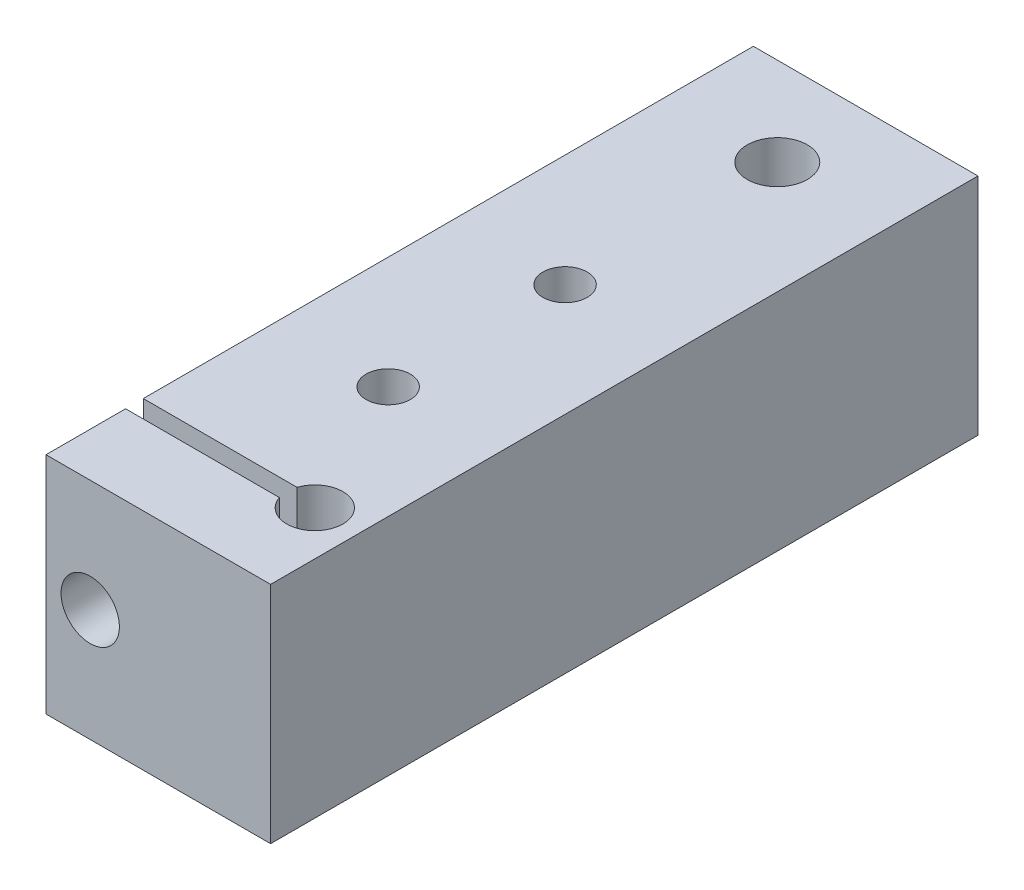
ISO-10303-21;
HEADER;
FILE_DESCRIPTION(('STEP AP214'),'2;1');
FILE_NAME('part.step','',(''),(''),'','','');
FILE_SCHEMA(('AUTOMOTIVE_DESIGN { 1 0 10303 214 1 1 1 1 }'));
ENDSEC;
DATA;
#1=APPLICATION_CONTEXT('core data for automotive mechanical design processes');
#2=APPLICATION_PROTOCOL_DEFINITION('international standard','automotive_design',2000,#1);
#3=PRODUCT_CONTEXT('',#1,'mechanical');
#4=PRODUCT('Part','Part','',(#3));
#5=PRODUCT_RELATED_PRODUCT_CATEGORY('part','',(#4));
#6=PRODUCT_DEFINITION_FORMATION('','',#4);
#7=PRODUCT_DEFINITION_CONTEXT('part definition',#1,'design');
#8=PRODUCT_DEFINITION('design','',#6,#7);
#9=PRODUCT_DEFINITION_SHAPE('','',#8);
#10=(LENGTH_UNIT() NAMED_UNIT(*) SI_UNIT(.MILLI.,.METRE.));
#11=(NAMED_UNIT(*) PLANE_ANGLE_UNIT() SI_UNIT($,.RADIAN.));
#12=(NAMED_UNIT(*) SI_UNIT($,.STERADIAN.) SOLID_ANGLE_UNIT());
#13=UNCERTAINTY_MEASURE_WITH_UNIT(LENGTH_MEASURE(1.E-05),#10,'distance_accuracy_value','');
#14=(GEOMETRIC_REPRESENTATION_CONTEXT(3) GLOBAL_UNCERTAINTY_ASSIGNED_CONTEXT((#13)) GLOBAL_UNIT_ASSIGNED_CONTEXT((#10,
#11,#12)) REPRESENTATION_CONTEXT('',''));
#15=CARTESIAN_POINT('',(0.,0.,0.));
#16=DIRECTION('',(0.,0.,1.));
#17=DIRECTION('',(1.,0.,0.));
#18=AXIS2_PLACEMENT_3D('',#15,#16,#17);
#19=CARTESIAN_POINT('',(0.,25.4,0.));
#20=DIRECTION('',(1.,0.,0.));
#21=DIRECTION('',(0.,0.,-1.));
#22=AXIS2_PLACEMENT_3D('',#19,#20,#21);
#23=PLANE('',#22);
#24=DIRECTION('',(0.,0.,1.));
#25=VECTOR('',#24,1.);
#26=CARTESIAN_POINT('',(0.,25.4,0.));
#27=LINE('',#26,#25);
#28=CARTESIAN_POINT('',(0.,25.4,-9.));
#29=VERTEX_POINT('',#28);
#30=CARTESIAN_POINT('',(0.,25.4,0.));
#31=VERTEX_POINT('',#30);
#32=EDGE_CURVE('E150',#29,#31,#27,.T.);
#33=ORIENTED_EDGE('',*,*,#32,.F.);
#34=DIRECTION('',(0.,1.,0.));
#35=VECTOR('',#34,1.);
#36=CARTESIAN_POINT('',(0.,0.,-9.));
#37=LINE('',#36,#35);
#38=CARTESIAN_POINT('',(0.,0.,-9.));
#39=VERTEX_POINT('',#38);
#40=EDGE_CURVE('E135',#39,#29,#37,.T.);
#41=ORIENTED_EDGE('',*,*,#40,.F.);
#42=DIRECTION('',(0.,0.,1.));
#43=VECTOR('',#42,1.);
#44=CARTESIAN_POINT('',(0.,0.,0.));
#45=LINE('',#44,#43);
#46=CARTESIAN_POINT('',(0.,0.,0.));
#47=VERTEX_POINT('',#46);
#48=EDGE_CURVE('E145',#39,#47,#45,.T.);
#49=ORIENTED_EDGE('',*,*,#48,.T.);
#50=DIRECTION('',(0.,-1.,0.));
#51=VECTOR('',#50,1.);
#52=CARTESIAN_POINT('',(0.,25.4,0.));
#53=LINE('',#52,#51);
#54=EDGE_CURVE('E174',#31,#47,#53,.T.);
#55=ORIENTED_EDGE('',*,*,#54,.F.);
#56=EDGE_LOOP('',(#33,#41,#49,#55));
#57=FACE_BOUND('',#56,.T.);
#58=ADVANCED_FACE('F39',(#57),#23,.F.);
#59=CARTESIAN_POINT('',(0.,0.,-80.));
#60=VERTEX_POINT('',#59);
#61=CARTESIAN_POINT('',(0.,0.,-11.));
#62=VERTEX_POINT('',#61);
#63=EDGE_CURVE('E157',#60,#62,#45,.T.);
#64=ORIENTED_EDGE('',*,*,#63,.T.);
#65=DIRECTION('',(0.,1.,0.));
#66=VECTOR('',#65,1.);
#67=CARTESIAN_POINT('',(0.,0.,-11.));
#68=LINE('',#67,#66);
#69=CARTESIAN_POINT('',(0.,25.4,-11.));
#70=VERTEX_POINT('',#69);
#71=EDGE_CURVE('E132',#62,#70,#68,.T.);
#72=ORIENTED_EDGE('',*,*,#71,.T.);
#73=CARTESIAN_POINT('',(0.,25.4,-80.));
#74=VERTEX_POINT('',#73);
#75=EDGE_CURVE('E146',#74,#70,#27,.T.);
#76=ORIENTED_EDGE('',*,*,#75,.F.);
#77=DIRECTION('',(0.,-1.,0.));
#78=VECTOR('',#77,1.);
#79=CARTESIAN_POINT('',(0.,25.4,-80.));
#80=LINE('',#79,#78);
#81=EDGE_CURVE('E156',#74,#60,#80,.T.);
#82=ORIENTED_EDGE('',*,*,#81,.T.);
#83=EDGE_LOOP('',(#64,#72,#76,#82));
#84=FACE_BOUND('',#83,.T.);
#85=ADVANCED_FACE('F41',(#84),#23,.F.);
#86=CARTESIAN_POINT('',(0.,25.4,0.));
#87=DIRECTION('',(0.,0.,-1.));
#88=DIRECTION('',(-1.,0.,0.));
#89=AXIS2_PLACEMENT_3D('',#86,#87,#88);
#90=PLANE('',#89);
#91=CARTESIAN_POINT('',(5.,12.7,0.));
#92=DIRECTION('',(0.,0.,1.));
#93=DIRECTION('',(1.,0.,0.));
#94=AXIS2_PLACEMENT_3D('',#91,#92,#93);
#95=CIRCLE('',#94,3.3);
#96=CARTESIAN_POINT('',(8.3,12.7,0.));
#97=VERTEX_POINT('',#96);
#98=EDGE_CURVE('E114',#97,#97,#95,.T.);
#99=ORIENTED_EDGE('',*,*,#98,.F.);
#100=EDGE_LOOP('',(#99));
#101=FACE_BOUND('',#100,.T.);
#102=DIRECTION('',(1.,0.,0.));
#103=VECTOR('',#102,1.);
#104=CARTESIAN_POINT('',(0.,0.,0.));
#105=LINE('',#104,#103);
#106=CARTESIAN_POINT('',(25.4,0.,0.));
#107=VERTEX_POINT('',#106);
#108=EDGE_CURVE('E160',#47,#107,#105,.T.);
#109=ORIENTED_EDGE('',*,*,#108,.T.);
#110=DIRECTION('',(0.,-1.,0.));
#111=VECTOR('',#110,1.);
#112=CARTESIAN_POINT('',(25.4,25.4,0.));
#113=LINE('',#112,#111);
#114=CARTESIAN_POINT('',(25.4,25.4,0.));
#115=VERTEX_POINT('',#114);
#116=EDGE_CURVE('E171',#115,#107,#113,.T.);
#117=ORIENTED_EDGE('',*,*,#116,.F.);
#118=DIRECTION('',(1.,0.,0.));
#119=VECTOR('',#118,1.);
#120=CARTESIAN_POINT('',(0.,25.4,0.));
#121=LINE('',#120,#119);
#122=EDGE_CURVE('E149',#31,#115,#121,.T.);
#123=ORIENTED_EDGE('',*,*,#122,.F.);
#124=ORIENTED_EDGE('',*,*,#54,.T.);
#125=EDGE_LOOP('',(#109,#117,#123,#124));
#126=FACE_BOUND('',#125,.T.);
#127=ADVANCED_FACE('F196',(#101,#126),#90,.F.);
#128=CARTESIAN_POINT('',(25.4,25.4,0.));
#129=DIRECTION('',(-1.,0.,0.));
#130=DIRECTION('',(0.,0.,1.));
#131=AXIS2_PLACEMENT_3D('',#128,#129,#130);
#132=PLANE('',#131);
#133=DIRECTION('',(0.,0.,-1.));
#134=VECTOR('',#133,1.);
#135=CARTESIAN_POINT('',(25.4,0.,0.));
#136=LINE('',#135,#134);
#137=CARTESIAN_POINT('',(25.4,0.,-80.));
#138=VERTEX_POINT('',#137);
#139=EDGE_CURVE('E162',#107,#138,#136,.T.);
#140=ORIENTED_EDGE('',*,*,#139,.T.);
#141=DIRECTION('',(0.,-1.,0.));
#142=VECTOR('',#141,1.);
#143=CARTESIAN_POINT('',(25.4,25.4,-80.));
#144=LINE('',#143,#142);
#145=CARTESIAN_POINT('',(25.4,25.4,-80.));
#146=VERTEX_POINT('',#145);
#147=EDGE_CURVE('E168',#146,#138,#144,.T.);
#148=ORIENTED_EDGE('',*,*,#147,.F.);
#149=DIRECTION('',(0.,0.,-1.));
#150=VECTOR('',#149,1.);
#151=CARTESIAN_POINT('',(25.4,25.4,0.));
#152=LINE('',#151,#150);
#153=EDGE_CURVE('E152',#115,#146,#152,.T.);
#154=ORIENTED_EDGE('',*,*,#153,.F.);
#155=ORIENTED_EDGE('',*,*,#116,.T.);
#156=EDGE_LOOP('',(#140,#148,#154,#155));
#157=FACE_BOUND('',#156,.T.);
#158=ADVANCED_FACE('F201',(#157),#132,.F.);
#159=CARTESIAN_POINT('',(0.,25.4,-80.));
#160=DIRECTION('',(0.,0.,1.));
#161=DIRECTION('',(1.,0.,0.));
#162=AXIS2_PLACEMENT_3D('',#159,#160,#161);
#163=PLANE('',#162);
#164=DIRECTION('',(-1.,0.,0.));
#165=VECTOR('',#164,1.);
#166=CARTESIAN_POINT('',(0.,0.,-80.));
#167=LINE('',#166,#165);
#168=EDGE_CURVE('E164',#138,#60,#167,.T.);
#169=ORIENTED_EDGE('',*,*,#168,.T.);
#170=ORIENTED_EDGE('',*,*,#81,.F.);
#171=DIRECTION('',(-1.,0.,0.));
#172=VECTOR('',#171,1.);
#173=CARTESIAN_POINT('',(0.,25.4,-80.));
#174=LINE('',#173,#172);
#175=EDGE_CURVE('E154',#146,#74,#174,.T.);
#176=ORIENTED_EDGE('',*,*,#175,.F.);
#177=ORIENTED_EDGE('',*,*,#147,.T.);
#178=EDGE_LOOP('',(#169,#170,#176,#177));
#179=FACE_BOUND('',#178,.T.);
#180=ADVANCED_FACE('F206',(#179),#163,.F.);
#181=CARTESIAN_POINT('',(0.,25.4,0.));
#182=DIRECTION('',(0.,-1.,0.));
#183=DIRECTION('',(0.,0.,-1.));
#184=AXIS2_PLACEMENT_3D('',#181,#182,#183);
#185=PLANE('',#184);
#186=CARTESIAN_POINT('',(12.7,25.4,-26.));
#187=DIRECTION('',(0.,-1.,0.));
#188=DIRECTION('',(0.,0.,-1.));
#189=AXIS2_PLACEMENT_3D('',#186,#187,#188);
#190=CIRCLE('',#189,2.49999999999999);
#191=CARTESIAN_POINT('',(12.7,25.4,-28.5));
#192=VERTEX_POINT('',#191);
#193=EDGE_CURVE('E247',#192,#192,#190,.F.);
#194=ORIENTED_EDGE('',*,*,#193,.F.);
#195=EDGE_LOOP('',(#194));
#196=FACE_BOUND('',#195,.T.);
#197=CARTESIAN_POINT('',(12.7,25.4,-46.));
#198=DIRECTION('',(0.,-1.,0.));
#199=DIRECTION('',(0.,0.,-1.));
#200=AXIS2_PLACEMENT_3D('',#197,#198,#199);
#201=CIRCLE('',#200,2.49999999999999);
#202=CARTESIAN_POINT('',(12.7,25.4,-48.5));
#203=VERTEX_POINT('',#202);
#204=EDGE_CURVE('E251',#203,#203,#201,.F.);
#205=ORIENTED_EDGE('',*,*,#204,.F.);
#206=EDGE_LOOP('',(#205));
#207=FACE_BOUND('',#206,.T.);
#208=CARTESIAN_POINT('',(12.7,25.4,-70.));
#209=DIRECTION('',(0.,1.,0.));
#210=DIRECTION('',(0.,0.,1.));
#211=AXIS2_PLACEMENT_3D('',#208,#209,#210);
#212=CIRCLE('',#211,3.39999999999999);
#213=CARTESIAN_POINT('',(12.7,25.4,-66.6));
#214=VERTEX_POINT('',#213);
#215=EDGE_CURVE('E254',#214,#214,#212,.T.);
#216=ORIENTED_EDGE('',*,*,#215,.F.);
#217=EDGE_LOOP('',(#216));
#218=FACE_BOUND('',#217,.T.);
#219=CARTESIAN_POINT('',(20.4,25.4,-10.));
#220=DIRECTION('',(0.,1.,0.));
#221=DIRECTION('',(0.,0.,1.));
#222=AXIS2_PLACEMENT_3D('',#219,#220,#221);
#223=CIRCLE('',#222,3.17499999999999);
#224=CARTESIAN_POINT('',(17.3865924603532,25.4,-9.));
#225=VERTEX_POINT('',#224);
#226=CARTESIAN_POINT('',(17.3865924603532,25.4,-11.));
#227=VERTEX_POINT('',#226);
#228=EDGE_CURVE('E137',#225,#227,#223,.T.);
#229=ORIENTED_EDGE('',*,*,#228,.F.);
#230=DIRECTION('',(1.,0.,0.));
#231=VECTOR('',#230,1.);
#232=CARTESIAN_POINT('',(0.,25.4,-9.));
#233=LINE('',#232,#231);
#234=EDGE_CURVE('E54',#29,#225,#233,.T.);
#235=ORIENTED_EDGE('',*,*,#234,.F.);
#236=ORIENTED_EDGE('',*,*,#32,.T.);
#237=ORIENTED_EDGE('',*,*,#122,.T.);
#238=ORIENTED_EDGE('',*,*,#153,.T.);
#239=ORIENTED_EDGE('',*,*,#175,.T.);
#240=ORIENTED_EDGE('',*,*,#75,.T.);
#241=DIRECTION('',(-1.,0.,0.));
#242=VECTOR('',#241,1.);
#243=CARTESIAN_POINT('',(0.,25.4,-11.));
#244=LINE('',#243,#242);
#245=EDGE_CURVE('E126',#227,#70,#244,.T.);
#246=ORIENTED_EDGE('',*,*,#245,.F.);
#247=EDGE_LOOP('',(#229,#235,#236,#237,#238,#239,#240,#246));
#248=FACE_BOUND('',#247,.T.);
#249=ADVANCED_FACE('F193',(#196,#207,#218,#248),#185,.F.);
#250=CARTESIAN_POINT('',(0.,0.,0.));
#251=DIRECTION('',(0.,-1.,0.));
#252=DIRECTION('',(0.,0.,-1.));
#253=AXIS2_PLACEMENT_3D('',#250,#251,#252);
#254=PLANE('',#253);
#255=CARTESIAN_POINT('',(12.7,0.,-26.));
#256=DIRECTION('',(0.,-1.,0.));
#257=DIRECTION('',(0.,0.,-1.));
#258=AXIS2_PLACEMENT_3D('',#255,#256,#257);
#259=CIRCLE('',#258,2.49999999999999);
#260=CARTESIAN_POINT('',(12.7,0.,-28.5));
#261=VERTEX_POINT('',#260);
#262=EDGE_CURVE('E263',#261,#261,#259,.T.);
#263=ORIENTED_EDGE('',*,*,#262,.F.);
#264=EDGE_LOOP('',(#263));
#265=FACE_BOUND('',#264,.T.);
#266=CARTESIAN_POINT('',(12.7,0.,-46.));
#267=DIRECTION('',(0.,-1.,0.));
#268=DIRECTION('',(0.,0.,-1.));
#269=AXIS2_PLACEMENT_3D('',#266,#267,#268);
#270=CIRCLE('',#269,2.49999999999999);
#271=CARTESIAN_POINT('',(12.7,0.,-48.5));
#272=VERTEX_POINT('',#271);
#273=EDGE_CURVE('E258',#272,#272,#270,.T.);
#274=ORIENTED_EDGE('',*,*,#273,.F.);
#275=EDGE_LOOP('',(#274));
#276=FACE_BOUND('',#275,.T.);
#277=CARTESIAN_POINT('',(12.7,0.,-70.));
#278=DIRECTION('',(0.,1.,0.));
#279=DIRECTION('',(0.,0.,1.));
#280=AXIS2_PLACEMENT_3D('',#277,#278,#279);
#281=CIRCLE('',#280,3.39999999999999);
#282=CARTESIAN_POINT('',(12.7,0.,-66.6));
#283=VERTEX_POINT('',#282);
#284=EDGE_CURVE('E121',#283,#283,#281,.T.);
#285=ORIENTED_EDGE('',*,*,#284,.T.);
#286=EDGE_LOOP('',(#285));
#287=FACE_BOUND('',#286,.T.);
#288=DIRECTION('',(1.,0.,0.));
#289=VECTOR('',#288,1.);
#290=CARTESIAN_POINT('',(0.,0.,-9.));
#291=LINE('',#290,#289);
#292=CARTESIAN_POINT('',(17.3865924603532,0.,-9.));
#293=VERTEX_POINT('',#292);
#294=EDGE_CURVE('E129',#39,#293,#291,.T.);
#295=ORIENTED_EDGE('',*,*,#294,.T.);
#296=CARTESIAN_POINT('',(20.4,0.,-10.));
#297=DIRECTION('',(0.,1.,0.));
#298=DIRECTION('',(0.,0.,1.));
#299=AXIS2_PLACEMENT_3D('',#296,#297,#298);
#300=CIRCLE('',#299,3.17499999999999);
#301=CARTESIAN_POINT('',(17.3865924603532,0.,-11.));
#302=VERTEX_POINT('',#301);
#303=EDGE_CURVE('E142',#293,#302,#300,.T.);
#304=ORIENTED_EDGE('',*,*,#303,.T.);
#305=DIRECTION('',(-1.,0.,0.));
#306=VECTOR('',#305,1.);
#307=CARTESIAN_POINT('',(0.,0.,-11.));
#308=LINE('',#307,#306);
#309=EDGE_CURVE('E61',#302,#62,#308,.T.);
#310=ORIENTED_EDGE('',*,*,#309,.T.);
#311=ORIENTED_EDGE('',*,*,#63,.F.);
#312=ORIENTED_EDGE('',*,*,#168,.F.);
#313=ORIENTED_EDGE('',*,*,#139,.F.);
#314=ORIENTED_EDGE('',*,*,#108,.F.);
#315=ORIENTED_EDGE('',*,*,#48,.F.);
#316=EDGE_LOOP('',(#295,#304,#310,#311,#312,#313,#314,#315));
#317=FACE_BOUND('',#316,.T.);
#318=ADVANCED_FACE('F182',(#265,#276,#287,#317),#254,.T.);
#319=CARTESIAN_POINT('',(20.4,25.4,-10.));
#320=DIRECTION('',(0.,1.,0.));
#321=DIRECTION('',(0.,0.,1.));
#322=AXIS2_PLACEMENT_3D('',#319,#320,#321);
#323=CYLINDRICAL_SURFACE('',#322,3.17499999999999);
#324=ORIENTED_EDGE('',*,*,#303,.F.);
#325=DIRECTION('',(0.,1.,0.));
#326=VECTOR('',#325,1.);
#327=CARTESIAN_POINT('',(17.3865924603532,25.4,-9.));
#328=LINE('',#327,#326);
#329=EDGE_CURVE('E11',#293,#225,#328,.T.);
#330=ORIENTED_EDGE('',*,*,#329,.T.);
#331=ORIENTED_EDGE('',*,*,#228,.T.);
#332=DIRECTION('',(0.,1.,0.));
#333=VECTOR('',#332,1.);
#334=CARTESIAN_POINT('',(17.3865924603532,25.4,-11.));
#335=LINE('',#334,#333);
#336=EDGE_CURVE('E47',#227,#302,#335,.F.);
#337=ORIENTED_EDGE('',*,*,#336,.T.);
#338=EDGE_LOOP('',(#324,#330,#331,#337));
#339=FACE_BOUND('',#338,.T.);
#340=ADVANCED_FACE('F178',(#339),#323,.F.);
#341=CARTESIAN_POINT('',(0.,0.,-11.));
#342=DIRECTION('',(0.,0.,-1.));
#343=DIRECTION('',(-1.,0.,0.));
#344=AXIS2_PLACEMENT_3D('',#341,#342,#343);
#345=PLANE('',#344);
#346=CARTESIAN_POINT('',(5.,12.7,-11.));
#347=DIRECTION('',(0.,0.,1.));
#348=DIRECTION('',(1.,0.,0.));
#349=AXIS2_PLACEMENT_3D('',#346,#347,#348);
#350=CIRCLE('',#349,2.5);
#351=CARTESIAN_POINT('',(7.5,12.7,-11.));
#352=VERTEX_POINT('',#351);
#353=EDGE_CURVE('E115',#352,#352,#350,.T.);
#354=ORIENTED_EDGE('',*,*,#353,.F.);
#355=EDGE_LOOP('',(#354));
#356=FACE_BOUND('',#355,.T.);
#357=ORIENTED_EDGE('',*,*,#245,.T.);
#358=ORIENTED_EDGE('',*,*,#71,.F.);
#359=ORIENTED_EDGE('',*,*,#309,.F.);
#360=ORIENTED_EDGE('',*,*,#336,.F.);
#361=EDGE_LOOP('',(#357,#358,#359,#360));
#362=FACE_BOUND('',#361,.T.);
#363=ADVANCED_FACE('F209',(#356,#362),#345,.F.);
#364=CARTESIAN_POINT('',(0.,0.,-9.));
#365=DIRECTION('',(0.,0.,1.));
#366=DIRECTION('',(1.,0.,0.));
#367=AXIS2_PLACEMENT_3D('',#364,#365,#366);
#368=PLANE('',#367);
#369=CARTESIAN_POINT('',(5.,12.7,-9.));
#370=DIRECTION('',(0.,0.,1.));
#371=DIRECTION('',(1.,0.,0.));
#372=AXIS2_PLACEMENT_3D('',#369,#370,#371);
#373=CIRCLE('',#372,3.3);
#374=CARTESIAN_POINT('',(8.3,12.7,-9.));
#375=VERTEX_POINT('',#374);
#376=EDGE_CURVE('E118',#375,#375,#373,.F.);
#377=ORIENTED_EDGE('',*,*,#376,.F.);
#378=EDGE_LOOP('',(#377));
#379=FACE_BOUND('',#378,.T.);
#380=ORIENTED_EDGE('',*,*,#294,.F.);
#381=ORIENTED_EDGE('',*,*,#40,.T.);
#382=ORIENTED_EDGE('',*,*,#234,.T.);
#383=ORIENTED_EDGE('',*,*,#329,.F.);
#384=EDGE_LOOP('',(#380,#381,#382,#383));
#385=FACE_BOUND('',#384,.T.);
#386=ADVANCED_FACE('F187',(#379,#385),#368,.F.);
#387=CARTESIAN_POINT('',(5.,12.7,0.));
#388=DIRECTION('',(0.,0.,1.));
#389=DIRECTION('',(1.,0.,0.));
#390=AXIS2_PLACEMENT_3D('',#387,#388,#389);
#391=CYLINDRICAL_SURFACE('',#390,3.3);
#392=ORIENTED_EDGE('',*,*,#376,.T.);
#393=EDGE_LOOP('',(#392));
#394=FACE_BOUND('',#393,.T.);
#395=ORIENTED_EDGE('',*,*,#98,.T.);
#396=EDGE_LOOP('',(#395));
#397=FACE_BOUND('',#396,.T.);
#398=ADVANCED_FACE('F108',(#394,#397),#391,.F.);
#399=CARTESIAN_POINT('',(5.,12.7,-28.));
#400=DIRECTION('',(0.,0.,1.));
#401=DIRECTION('',(1.,0.,0.));
#402=AXIS2_PLACEMENT_3D('',#399,#400,#401);
#403=CONICAL_SURFACE('',#402,2.5,1.02974425867665);
#404=CARTESIAN_POINT('',(5.,12.7,-29.5021515475689));
#405=VERTEX_POINT('',#404);
#406=VERTEX_LOOP('',#405);
#407=FACE_BOUND('',#406,.T.);
#408=CARTESIAN_POINT('',(5.,12.7,-28.));
#409=DIRECTION('',(0.,0.,1.));
#410=DIRECTION('',(1.,0.,0.));
#411=AXIS2_PLACEMENT_3D('',#408,#409,#410);
#412=CIRCLE('',#411,2.5);
#413=CARTESIAN_POINT('',(7.5,12.7,-28.));
#414=VERTEX_POINT('',#413);
#415=EDGE_CURVE('E112',#414,#414,#412,.T.);
#416=ORIENTED_EDGE('',*,*,#415,.T.);
#417=EDGE_LOOP('',(#416));
#418=FACE_BOUND('',#417,.T.);
#419=ADVANCED_FACE('F104',(#407,#418),#403,.F.);
#420=CARTESIAN_POINT('',(5.,12.7,-11.));
#421=DIRECTION('',(0.,0.,1.));
#422=DIRECTION('',(1.,0.,0.));
#423=AXIS2_PLACEMENT_3D('',#420,#421,#422);
#424=CYLINDRICAL_SURFACE('',#423,2.5);
#425=ORIENTED_EDGE('',*,*,#415,.F.);
#426=EDGE_LOOP('',(#425));
#427=FACE_BOUND('',#426,.T.);
#428=ORIENTED_EDGE('',*,*,#353,.T.);
#429=EDGE_LOOP('',(#428));
#430=FACE_BOUND('',#429,.T.);
#431=ADVANCED_FACE('F107',(#427,#430),#424,.F.);
#432=CARTESIAN_POINT('',(12.7,25.4,-70.));
#433=DIRECTION('',(0.,1.,0.));
#434=DIRECTION('',(0.,0.,1.));
#435=AXIS2_PLACEMENT_3D('',#432,#433,#434);
#436=CYLINDRICAL_SURFACE('',#435,3.39999999999999);
#437=ORIENTED_EDGE('',*,*,#284,.F.);
#438=EDGE_LOOP('',(#437));
#439=FACE_BOUND('',#438,.T.);
#440=ORIENTED_EDGE('',*,*,#215,.T.);
#441=EDGE_LOOP('',(#440));
#442=FACE_BOUND('',#441,.T.);
#443=ADVANCED_FACE('F278',(#439,#442),#436,.F.);
#444=CARTESIAN_POINT('',(12.7,0.,-46.));
#445=DIRECTION('',(0.,-1.,0.));
#446=DIRECTION('',(0.,0.,-1.));
#447=AXIS2_PLACEMENT_3D('',#444,#445,#446);
#448=CYLINDRICAL_SURFACE('',#447,2.49999999999999);
#449=ORIENTED_EDGE('',*,*,#204,.T.);
#450=EDGE_LOOP('',(#449));
#451=FACE_BOUND('',#450,.T.);
#452=ORIENTED_EDGE('',*,*,#273,.T.);
#453=EDGE_LOOP('',(#452));
#454=FACE_BOUND('',#453,.T.);
#455=ADVANCED_FACE('F270',(#451,#454),#448,.F.);
#456=CARTESIAN_POINT('',(12.7,0.,-26.));
#457=DIRECTION('',(0.,-1.,0.));
#458=DIRECTION('',(0.,0.,-1.));
#459=AXIS2_PLACEMENT_3D('',#456,#457,#458);
#460=CYLINDRICAL_SURFACE('',#459,2.49999999999999);
#461=ORIENTED_EDGE('',*,*,#193,.T.);
#462=EDGE_LOOP('',(#461));
#463=FACE_BOUND('',#462,.T.);
#464=ORIENTED_EDGE('',*,*,#262,.T.);
#465=EDGE_LOOP('',(#464));
#466=FACE_BOUND('',#465,.T.);
#467=ADVANCED_FACE('F267',(#463,#466),#460,.F.);
#468=CLOSED_SHELL('',(#58,#85,#127,#158,#180,#249,#318,#340,#363,#386,#398,#419,#431,#443,#455,#467));
#469=MANIFOLD_SOLID_BREP('B2',#468);
#470=ADVANCED_BREP_SHAPE_REPRESENTATION('',(#18,#469),#14);
#471=SHAPE_DEFINITION_REPRESENTATION(#9,#470);
ENDSEC;
END-ISO-10303-21;
